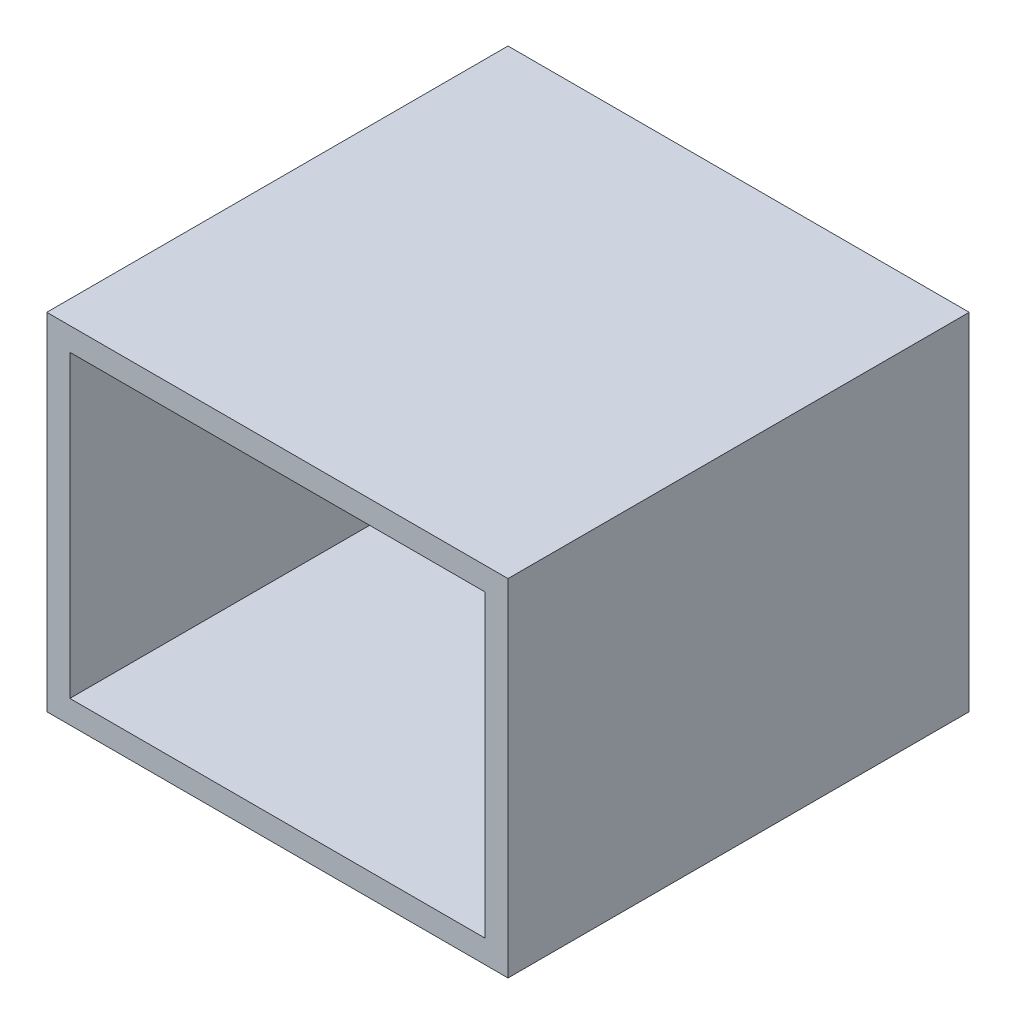
ISO-10303-21;
HEADER;
FILE_DESCRIPTION(('STEP AP214'),'2;1');
FILE_NAME('part.step','',(''),(''),'','','');
FILE_SCHEMA(('AUTOMOTIVE_DESIGN { 1 0 10303 214 1 1 1 1 }'));
ENDSEC;
DATA;
#1=APPLICATION_CONTEXT('core data for automotive mechanical design processes');
#2=APPLICATION_PROTOCOL_DEFINITION('international standard','automotive_design',2000,#1);
#3=PRODUCT_CONTEXT('',#1,'mechanical');
#4=PRODUCT('Part','Part','',(#3));
#5=PRODUCT_RELATED_PRODUCT_CATEGORY('part','',(#4));
#6=PRODUCT_DEFINITION_FORMATION('','',#4);
#7=PRODUCT_DEFINITION_CONTEXT('part definition',#1,'design');
#8=PRODUCT_DEFINITION('design','',#6,#7);
#9=PRODUCT_DEFINITION_SHAPE('','',#8);
#10=(LENGTH_UNIT() NAMED_UNIT(*) SI_UNIT(.MILLI.,.METRE.));
#11=(NAMED_UNIT(*) PLANE_ANGLE_UNIT() SI_UNIT($,.RADIAN.));
#12=(NAMED_UNIT(*) SI_UNIT($,.STERADIAN.) SOLID_ANGLE_UNIT());
#13=UNCERTAINTY_MEASURE_WITH_UNIT(LENGTH_MEASURE(1.E-05),#10,'distance_accuracy_value','');
#14=(GEOMETRIC_REPRESENTATION_CONTEXT(3) GLOBAL_UNCERTAINTY_ASSIGNED_CONTEXT((#13)) GLOBAL_UNIT_ASSIGNED_CONTEXT((#10,
#11,#12)) REPRESENTATION_CONTEXT('',''));
#15=CARTESIAN_POINT('',(0.,0.,0.));
#16=DIRECTION('',(0.,0.,1.));
#17=DIRECTION('',(1.,0.,0.));
#18=AXIS2_PLACEMENT_3D('',#15,#16,#17);
#19=CARTESIAN_POINT('',(0.,0.,200.));
#20=DIRECTION('',(0.,0.,-1.));
#21=DIRECTION('',(-1.,0.,0.));
#22=AXIS2_PLACEMENT_3D('',#19,#20,#21);
#23=PLANE('',#22);
#24=DIRECTION('',(0.,-1.,0.));
#25=VECTOR('',#24,1.);
#26=CARTESIAN_POINT('',(0.,0.,200.));
#27=LINE('',#26,#25);
#28=CARTESIAN_POINT('',(0.,150.,200.));
#29=VERTEX_POINT('',#28);
#30=CARTESIAN_POINT('',(0.,0.,200.));
#31=VERTEX_POINT('',#30);
#32=EDGE_CURVE('E137',#29,#31,#27,.T.);
#33=ORIENTED_EDGE('',*,*,#32,.T.);
#34=DIRECTION('',(1.,0.,0.));
#35=VECTOR('',#34,1.);
#36=CARTESIAN_POINT('',(0.,0.,200.));
#37=LINE('',#36,#35);
#38=CARTESIAN_POINT('',(200.,0.,200.));
#39=VERTEX_POINT('',#38);
#40=EDGE_CURVE('E140',#31,#39,#37,.T.);
#41=ORIENTED_EDGE('',*,*,#40,.T.);
#42=DIRECTION('',(0.,1.,0.));
#43=VECTOR('',#42,1.);
#44=CARTESIAN_POINT('',(200.,0.,200.));
#45=LINE('',#44,#43);
#46=CARTESIAN_POINT('',(200.,150.,200.));
#47=VERTEX_POINT('',#46);
#48=EDGE_CURVE('E143',#39,#47,#45,.T.);
#49=ORIENTED_EDGE('',*,*,#48,.T.);
#50=DIRECTION('',(-1.,0.,0.));
#51=VECTOR('',#50,1.);
#52=CARTESIAN_POINT('',(0.,150.,200.));
#53=LINE('',#52,#51);
#54=EDGE_CURVE('E145',#47,#29,#53,.T.);
#55=ORIENTED_EDGE('',*,*,#54,.T.);
#56=EDGE_LOOP('',(#33,#41,#49,#55));
#57=FACE_BOUND('',#56,.T.);
#58=DIRECTION('',(0.,-1.,0.));
#59=VECTOR('',#58,1.);
#60=CARTESIAN_POINT('',(10.,10.,200.));
#61=LINE('',#60,#59);
#62=CARTESIAN_POINT('',(10.,140.,200.));
#63=VERTEX_POINT('',#62);
#64=CARTESIAN_POINT('',(10.,10.,200.));
#65=VERTEX_POINT('',#64);
#66=EDGE_CURVE('E101',#63,#65,#61,.T.);
#67=ORIENTED_EDGE('',*,*,#66,.F.);
#68=DIRECTION('',(-1.,0.,0.));
#69=VECTOR('',#68,1.);
#70=CARTESIAN_POINT('',(10.,140.,200.));
#71=LINE('',#70,#69);
#72=CARTESIAN_POINT('',(190.,140.,200.));
#73=VERTEX_POINT('',#72);
#74=EDGE_CURVE('E123',#73,#63,#71,.T.);
#75=ORIENTED_EDGE('',*,*,#74,.F.);
#76=DIRECTION('',(0.,1.,0.));
#77=VECTOR('',#76,1.);
#78=CARTESIAN_POINT('',(190.,10.,200.));
#79=LINE('',#78,#77);
#80=CARTESIAN_POINT('',(190.,10.,200.));
#81=VERTEX_POINT('',#80);
#82=EDGE_CURVE('E121',#81,#73,#79,.T.);
#83=ORIENTED_EDGE('',*,*,#82,.F.);
#84=DIRECTION('',(1.,0.,0.));
#85=VECTOR('',#84,1.);
#86=CARTESIAN_POINT('',(10.,10.,200.));
#87=LINE('',#86,#85);
#88=EDGE_CURVE('E109',#65,#81,#87,.T.);
#89=ORIENTED_EDGE('',*,*,#88,.F.);
#90=EDGE_LOOP('',(#67,#75,#83,#89));
#91=FACE_BOUND('',#90,.T.);
#92=ADVANCED_FACE('F36',(#57,#91),#23,.F.);
#93=CARTESIAN_POINT('',(0.,0.,0.));
#94=DIRECTION('',(0.,0.,-1.));
#95=DIRECTION('',(-1.,0.,0.));
#96=AXIS2_PLACEMENT_3D('',#93,#94,#95);
#97=PLANE('',#96);
#98=DIRECTION('',(0.,-1.,0.));
#99=VECTOR('',#98,1.);
#100=CARTESIAN_POINT('',(0.,0.,0.));
#101=LINE('',#100,#99);
#102=CARTESIAN_POINT('',(0.,150.,0.));
#103=VERTEX_POINT('',#102);
#104=CARTESIAN_POINT('',(0.,0.,0.));
#105=VERTEX_POINT('',#104);
#106=EDGE_CURVE('E117',#103,#105,#101,.T.);
#107=ORIENTED_EDGE('',*,*,#106,.F.);
#108=DIRECTION('',(-1.,0.,0.));
#109=VECTOR('',#108,1.);
#110=CARTESIAN_POINT('',(0.,150.,0.));
#111=LINE('',#110,#109);
#112=CARTESIAN_POINT('',(200.,150.,0.));
#113=VERTEX_POINT('',#112);
#114=EDGE_CURVE('E141',#113,#103,#111,.T.);
#115=ORIENTED_EDGE('',*,*,#114,.F.);
#116=DIRECTION('',(0.,1.,0.));
#117=VECTOR('',#116,1.);
#118=CARTESIAN_POINT('',(200.,0.,0.));
#119=LINE('',#118,#117);
#120=CARTESIAN_POINT('',(200.,0.,0.));
#121=VERTEX_POINT('',#120);
#122=EDGE_CURVE('E152',#121,#113,#119,.T.);
#123=ORIENTED_EDGE('',*,*,#122,.F.);
#124=DIRECTION('',(1.,0.,0.));
#125=VECTOR('',#124,1.);
#126=CARTESIAN_POINT('',(0.,0.,0.));
#127=LINE('',#126,#125);
#128=EDGE_CURVE('E150',#105,#121,#127,.T.);
#129=ORIENTED_EDGE('',*,*,#128,.F.);
#130=EDGE_LOOP('',(#107,#115,#123,#129));
#131=FACE_BOUND('',#130,.T.);
#132=DIRECTION('',(-1.,0.,0.));
#133=VECTOR('',#132,1.);
#134=CARTESIAN_POINT('',(10.,140.,0.));
#135=LINE('',#134,#133);
#136=CARTESIAN_POINT('',(190.,140.,0.));
#137=VERTEX_POINT('',#136);
#138=CARTESIAN_POINT('',(10.,140.,0.));
#139=VERTEX_POINT('',#138);
#140=EDGE_CURVE('E110',#137,#139,#135,.T.);
#141=ORIENTED_EDGE('',*,*,#140,.T.);
#142=DIRECTION('',(0.,-1.,0.));
#143=VECTOR('',#142,1.);
#144=CARTESIAN_POINT('',(10.,10.,0.));
#145=LINE('',#144,#143);
#146=CARTESIAN_POINT('',(10.,10.,0.));
#147=VERTEX_POINT('',#146);
#148=EDGE_CURVE('E59',#139,#147,#145,.T.);
#149=ORIENTED_EDGE('',*,*,#148,.T.);
#150=DIRECTION('',(1.,0.,0.));
#151=VECTOR('',#150,1.);
#152=CARTESIAN_POINT('',(10.,10.,0.));
#153=LINE('',#152,#151);
#154=CARTESIAN_POINT('',(190.,10.,0.));
#155=VERTEX_POINT('',#154);
#156=EDGE_CURVE('E116',#147,#155,#153,.T.);
#157=ORIENTED_EDGE('',*,*,#156,.T.);
#158=DIRECTION('',(0.,1.,0.));
#159=VECTOR('',#158,1.);
#160=CARTESIAN_POINT('',(190.,10.,0.));
#161=LINE('',#160,#159);
#162=EDGE_CURVE('E129',#155,#137,#161,.T.);
#163=ORIENTED_EDGE('',*,*,#162,.T.);
#164=EDGE_LOOP('',(#141,#149,#157,#163));
#165=FACE_BOUND('',#164,.T.);
#166=ADVANCED_FACE('F170',(#131,#165),#97,.T.);
#167=CARTESIAN_POINT('',(0.,0.,200.));
#168=DIRECTION('',(1.,0.,0.));
#169=DIRECTION('',(0.,0.,-1.));
#170=AXIS2_PLACEMENT_3D('',#167,#168,#169);
#171=PLANE('',#170);
#172=ORIENTED_EDGE('',*,*,#106,.T.);
#173=DIRECTION('',(0.,0.,-1.));
#174=VECTOR('',#173,1.);
#175=CARTESIAN_POINT('',(0.,0.,200.));
#176=LINE('',#175,#174);
#177=EDGE_CURVE('E11',#31,#105,#176,.T.);
#178=ORIENTED_EDGE('',*,*,#177,.F.);
#179=ORIENTED_EDGE('',*,*,#32,.F.);
#180=DIRECTION('',(0.,0.,-1.));
#181=VECTOR('',#180,1.);
#182=CARTESIAN_POINT('',(0.,150.,200.));
#183=LINE('',#182,#181);
#184=EDGE_CURVE('E147',#29,#103,#183,.T.);
#185=ORIENTED_EDGE('',*,*,#184,.T.);
#186=EDGE_LOOP('',(#172,#178,#179,#185));
#187=FACE_BOUND('',#186,.T.);
#188=ADVANCED_FACE('F38',(#187),#171,.F.);
#189=CARTESIAN_POINT('',(0.,0.,200.));
#190=DIRECTION('',(0.,1.,0.));
#191=DIRECTION('',(0.,0.,1.));
#192=AXIS2_PLACEMENT_3D('',#189,#190,#191);
#193=PLANE('',#192);
#194=ORIENTED_EDGE('',*,*,#128,.T.);
#195=DIRECTION('',(0.,0.,-1.));
#196=VECTOR('',#195,1.);
#197=CARTESIAN_POINT('',(200.,0.,200.));
#198=LINE('',#197,#196);
#199=EDGE_CURVE('E44',#39,#121,#198,.T.);
#200=ORIENTED_EDGE('',*,*,#199,.F.);
#201=ORIENTED_EDGE('',*,*,#40,.F.);
#202=ORIENTED_EDGE('',*,*,#177,.T.);
#203=EDGE_LOOP('',(#194,#200,#201,#202));
#204=FACE_BOUND('',#203,.T.);
#205=ADVANCED_FACE('F180',(#204),#193,.F.);
#206=CARTESIAN_POINT('',(200.,0.,200.));
#207=DIRECTION('',(-1.,0.,0.));
#208=DIRECTION('',(0.,0.,1.));
#209=AXIS2_PLACEMENT_3D('',#206,#207,#208);
#210=PLANE('',#209);
#211=ORIENTED_EDGE('',*,*,#122,.T.);
#212=DIRECTION('',(0.,0.,-1.));
#213=VECTOR('',#212,1.);
#214=CARTESIAN_POINT('',(200.,150.,200.));
#215=LINE('',#214,#213);
#216=EDGE_CURVE('E157',#47,#113,#215,.T.);
#217=ORIENTED_EDGE('',*,*,#216,.F.);
#218=ORIENTED_EDGE('',*,*,#48,.F.);
#219=ORIENTED_EDGE('',*,*,#199,.T.);
#220=EDGE_LOOP('',(#211,#217,#218,#219));
#221=FACE_BOUND('',#220,.T.);
#222=ADVANCED_FACE('F164',(#221),#210,.F.);
#223=CARTESIAN_POINT('',(0.,150.,200.));
#224=DIRECTION('',(0.,-1.,0.));
#225=DIRECTION('',(1.,0.,0.));
#226=AXIS2_PLACEMENT_3D('',#223,#224,#225);
#227=PLANE('',#226);
#228=ORIENTED_EDGE('',*,*,#114,.T.);
#229=ORIENTED_EDGE('',*,*,#184,.F.);
#230=ORIENTED_EDGE('',*,*,#54,.F.);
#231=ORIENTED_EDGE('',*,*,#216,.T.);
#232=EDGE_LOOP('',(#228,#229,#230,#231));
#233=FACE_BOUND('',#232,.T.);
#234=ADVANCED_FACE('F174',(#233),#227,.F.);
#235=CARTESIAN_POINT('',(10.,10.,200.));
#236=DIRECTION('',(1.,0.,0.));
#237=DIRECTION('',(0.,0.,-1.));
#238=AXIS2_PLACEMENT_3D('',#235,#236,#237);
#239=PLANE('',#238);
#240=ORIENTED_EDGE('',*,*,#148,.F.);
#241=DIRECTION('',(0.,0.,-1.));
#242=VECTOR('',#241,1.);
#243=CARTESIAN_POINT('',(10.,140.,200.));
#244=LINE('',#243,#242);
#245=EDGE_CURVE('E105',#63,#139,#244,.T.);
#246=ORIENTED_EDGE('',*,*,#245,.F.);
#247=ORIENTED_EDGE('',*,*,#66,.T.);
#248=DIRECTION('',(0.,0.,-1.));
#249=VECTOR('',#248,1.);
#250=CARTESIAN_POINT('',(10.,10.,200.));
#251=LINE('',#250,#249);
#252=EDGE_CURVE('E104',#65,#147,#251,.T.);
#253=ORIENTED_EDGE('',*,*,#252,.T.);
#254=EDGE_LOOP('',(#240,#246,#247,#253));
#255=FACE_BOUND('',#254,.T.);
#256=ADVANCED_FACE('F103',(#255),#239,.T.);
#257=CARTESIAN_POINT('',(10.,10.,200.));
#258=DIRECTION('',(0.,1.,0.));
#259=DIRECTION('',(0.,0.,1.));
#260=AXIS2_PLACEMENT_3D('',#257,#258,#259);
#261=PLANE('',#260);
#262=ORIENTED_EDGE('',*,*,#156,.F.);
#263=ORIENTED_EDGE('',*,*,#252,.F.);
#264=ORIENTED_EDGE('',*,*,#88,.T.);
#265=DIRECTION('',(0.,0.,-1.));
#266=VECTOR('',#265,1.);
#267=CARTESIAN_POINT('',(190.,10.,200.));
#268=LINE('',#267,#266);
#269=EDGE_CURVE('E118',#81,#155,#268,.T.);
#270=ORIENTED_EDGE('',*,*,#269,.T.);
#271=EDGE_LOOP('',(#262,#263,#264,#270));
#272=FACE_BOUND('',#271,.T.);
#273=ADVANCED_FACE('F113',(#272),#261,.T.);
#274=CARTESIAN_POINT('',(190.,10.,200.));
#275=DIRECTION('',(-1.,0.,0.));
#276=DIRECTION('',(0.,0.,1.));
#277=AXIS2_PLACEMENT_3D('',#274,#275,#276);
#278=PLANE('',#277);
#279=ORIENTED_EDGE('',*,*,#162,.F.);
#280=ORIENTED_EDGE('',*,*,#269,.F.);
#281=ORIENTED_EDGE('',*,*,#82,.T.);
#282=DIRECTION('',(0.,0.,-1.));
#283=VECTOR('',#282,1.);
#284=CARTESIAN_POINT('',(190.,140.,200.));
#285=LINE('',#284,#283);
#286=EDGE_CURVE('E51',#73,#137,#285,.T.);
#287=ORIENTED_EDGE('',*,*,#286,.T.);
#288=EDGE_LOOP('',(#279,#280,#281,#287));
#289=FACE_BOUND('',#288,.T.);
#290=ADVANCED_FACE('F203',(#289),#278,.T.);
#291=CARTESIAN_POINT('',(10.,140.,200.));
#292=DIRECTION('',(0.,-1.,0.));
#293=DIRECTION('',(0.,0.,-1.));
#294=AXIS2_PLACEMENT_3D('',#291,#292,#293);
#295=PLANE('',#294);
#296=ORIENTED_EDGE('',*,*,#140,.F.);
#297=ORIENTED_EDGE('',*,*,#286,.F.);
#298=ORIENTED_EDGE('',*,*,#74,.T.);
#299=ORIENTED_EDGE('',*,*,#245,.T.);
#300=EDGE_LOOP('',(#296,#297,#298,#299));
#301=FACE_BOUND('',#300,.T.);
#302=ADVANCED_FACE('F207',(#301),#295,.T.);
#303=CLOSED_SHELL('',(#92,#166,#188,#205,#222,#234,#256,#273,#290,#302));
#304=MANIFOLD_SOLID_BREP('B2',#303);
#305=ADVANCED_BREP_SHAPE_REPRESENTATION('',(#18,#304),#14);
#306=SHAPE_DEFINITION_REPRESENTATION(#9,#305);
ENDSEC;
END-ISO-10303-21;
